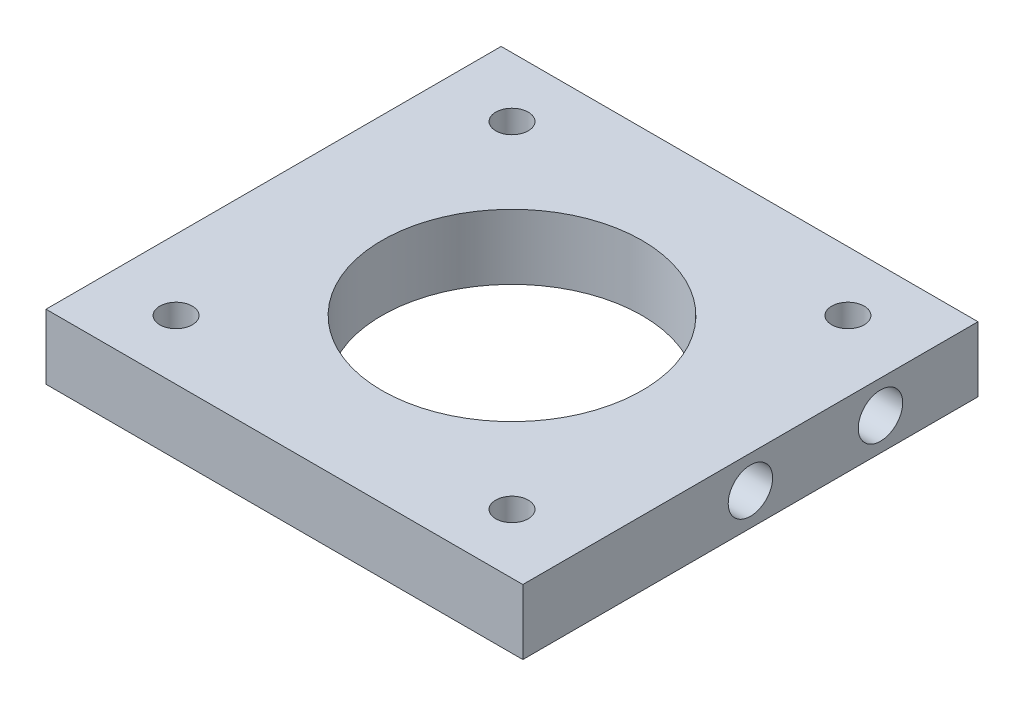
ISO-10303-21;
HEADER;
FILE_DESCRIPTION(('STEP AP214'),'2;1');
FILE_NAME('part.step','',(''),(''),'','','');
FILE_SCHEMA(('AUTOMOTIVE_DESIGN { 1 0 10303 214 1 1 1 1 }'));
ENDSEC;
DATA;
#1=APPLICATION_CONTEXT('core data for automotive mechanical design processes');
#2=APPLICATION_PROTOCOL_DEFINITION('international standard','automotive_design',2000,#1);
#3=PRODUCT_CONTEXT('',#1,'mechanical');
#4=PRODUCT('Part','Part','',(#3));
#5=PRODUCT_RELATED_PRODUCT_CATEGORY('part','',(#4));
#6=PRODUCT_DEFINITION_FORMATION('','',#4);
#7=PRODUCT_DEFINITION_CONTEXT('part definition',#1,'design');
#8=PRODUCT_DEFINITION('design','',#6,#7);
#9=PRODUCT_DEFINITION_SHAPE('','',#8);
#10=(LENGTH_UNIT() NAMED_UNIT(*) SI_UNIT(.MILLI.,.METRE.));
#11=(NAMED_UNIT(*) PLANE_ANGLE_UNIT() SI_UNIT($,.RADIAN.));
#12=(NAMED_UNIT(*) SI_UNIT($,.STERADIAN.) SOLID_ANGLE_UNIT());
#13=UNCERTAINTY_MEASURE_WITH_UNIT(LENGTH_MEASURE(1.E-05),#10,'distance_accuracy_value','');
#14=(GEOMETRIC_REPRESENTATION_CONTEXT(3) GLOBAL_UNCERTAINTY_ASSIGNED_CONTEXT((#13)) GLOBAL_UNIT_ASSIGNED_CONTEXT((#10,
#11,#12)) REPRESENTATION_CONTEXT('',''));
#15=CARTESIAN_POINT('',(0.,0.,0.));
#16=DIRECTION('',(0.,0.,1.));
#17=DIRECTION('',(1.,0.,0.));
#18=AXIS2_PLACEMENT_3D('',#15,#16,#17);
#19=CARTESIAN_POINT('',(-22.,3.,42.));
#20=DIRECTION('',(0.,1.,0.));
#21=DIRECTION('',(0.,0.,1.));
#22=AXIS2_PLACEMENT_3D('',#19,#20,#21);
#23=PLANE('',#22);
#24=CARTESIAN_POINT('',(-15.5,3.,36.5));
#25=DIRECTION('',(0.,1.,0.));
#26=DIRECTION('',(0.,0.,1.));
#27=AXIS2_PLACEMENT_3D('',#24,#25,#26);
#28=CIRCLE('',#27,1.5);
#29=CARTESIAN_POINT('',(-15.5,3.,38.));
#30=VERTEX_POINT('',#29);
#31=EDGE_CURVE('E145',#30,#30,#28,.T.);
#32=ORIENTED_EDGE('',*,*,#31,.F.);
#33=EDGE_LOOP('',(#32));
#34=FACE_BOUND('',#33,.T.);
#35=CARTESIAN_POINT('',(15.5,3.,36.5));
#36=DIRECTION('',(0.,1.,0.));
#37=DIRECTION('',(0.,0.,1.));
#38=AXIS2_PLACEMENT_3D('',#35,#36,#37);
#39=CIRCLE('',#38,1.5);
#40=CARTESIAN_POINT('',(15.5,3.,38.));
#41=VERTEX_POINT('',#40);
#42=EDGE_CURVE('E170',#41,#41,#39,.T.);
#43=ORIENTED_EDGE('',*,*,#42,.F.);
#44=EDGE_LOOP('',(#43));
#45=FACE_BOUND('',#44,.T.);
#46=CARTESIAN_POINT('',(15.5,3.,5.5));
#47=DIRECTION('',(0.,1.,0.));
#48=DIRECTION('',(0.,0.,1.));
#49=AXIS2_PLACEMENT_3D('',#46,#47,#48);
#50=CIRCLE('',#49,1.5);
#51=CARTESIAN_POINT('',(15.5,3.,7.));
#52=VERTEX_POINT('',#51);
#53=EDGE_CURVE('E164',#52,#52,#50,.T.);
#54=ORIENTED_EDGE('',*,*,#53,.F.);
#55=EDGE_LOOP('',(#54));
#56=FACE_BOUND('',#55,.T.);
#57=CARTESIAN_POINT('',(-15.5,3.,5.5));
#58=DIRECTION('',(0.,1.,0.));
#59=DIRECTION('',(0.,0.,1.));
#60=AXIS2_PLACEMENT_3D('',#57,#58,#59);
#61=CIRCLE('',#60,1.5);
#62=CARTESIAN_POINT('',(-15.5,3.,7.));
#63=VERTEX_POINT('',#62);
#64=EDGE_CURVE('E156',#63,#63,#61,.T.);
#65=ORIENTED_EDGE('',*,*,#64,.F.);
#66=EDGE_LOOP('',(#65));
#67=FACE_BOUND('',#66,.T.);
#68=CARTESIAN_POINT('',(0.,3.,21.));
#69=DIRECTION('',(0.,1.,0.));
#70=DIRECTION('',(0.,0.,1.));
#71=AXIS2_PLACEMENT_3D('',#68,#69,#70);
#72=CIRCLE('',#71,12.);
#73=CARTESIAN_POINT('',(0.,3.,33.));
#74=VERTEX_POINT('',#73);
#75=EDGE_CURVE('E163',#74,#74,#72,.T.);
#76=ORIENTED_EDGE('',*,*,#75,.F.);
#77=EDGE_LOOP('',(#76));
#78=FACE_BOUND('',#77,.T.);
#79=DIRECTION('',(1.,0.,0.));
#80=VECTOR('',#79,1.);
#81=CARTESIAN_POINT('',(-22.,3.,0.));
#82=LINE('',#81,#80);
#83=CARTESIAN_POINT('',(-22.,3.,0.));
#84=VERTEX_POINT('',#83);
#85=CARTESIAN_POINT('',(22.,3.,0.));
#86=VERTEX_POINT('',#85);
#87=EDGE_CURVE('E97',#84,#86,#82,.T.);
#88=ORIENTED_EDGE('',*,*,#87,.F.);
#89=DIRECTION('',(0.,0.,-1.));
#90=VECTOR('',#89,1.);
#91=CARTESIAN_POINT('',(-22.,3.,42.));
#92=LINE('',#91,#90);
#93=CARTESIAN_POINT('',(-22.,3.,42.));
#94=VERTEX_POINT('',#93);
#95=EDGE_CURVE('E11',#94,#84,#92,.T.);
#96=ORIENTED_EDGE('',*,*,#95,.F.);
#97=DIRECTION('',(1.,0.,0.));
#98=VECTOR('',#97,1.);
#99=CARTESIAN_POINT('',(-22.,3.,42.));
#100=LINE('',#99,#98);
#101=CARTESIAN_POINT('',(22.,3.,42.));
#102=VERTEX_POINT('',#101);
#103=EDGE_CURVE('E90',#94,#102,#100,.T.);
#104=ORIENTED_EDGE('',*,*,#103,.T.);
#105=DIRECTION('',(0.,0.,-1.));
#106=VECTOR('',#105,1.);
#107=CARTESIAN_POINT('',(22.,3.,42.));
#108=LINE('',#107,#106);
#109=EDGE_CURVE('E35',#102,#86,#108,.T.);
#110=ORIENTED_EDGE('',*,*,#109,.T.);
#111=EDGE_LOOP('',(#88,#96,#104,#110));
#112=FACE_BOUND('',#111,.T.);
#113=ADVANCED_FACE('F32',(#34,#45,#56,#67,#78,#112),#23,.T.);
#114=CARTESIAN_POINT('',(-22.,-3.,42.));
#115=DIRECTION('',(-1.,0.,0.));
#116=DIRECTION('',(0.,-1.,0.));
#117=AXIS2_PLACEMENT_3D('',#114,#115,#116);
#118=PLANE('',#117);
#119=CARTESIAN_POINT('',(-22.,0.,9.));
#120=DIRECTION('',(-1.,0.,0.));
#121=DIRECTION('',(0.,-1.,0.));
#122=AXIS2_PLACEMENT_3D('',#119,#120,#121);
#123=CIRCLE('',#122,2.05);
#124=CARTESIAN_POINT('',(-22.,-2.04999999999999,9.));
#125=VERTEX_POINT('',#124);
#126=EDGE_CURVE('E146',#125,#125,#123,.T.);
#127=ORIENTED_EDGE('',*,*,#126,.F.);
#128=EDGE_LOOP('',(#127));
#129=FACE_BOUND('',#128,.T.);
#130=CARTESIAN_POINT('',(-22.,0.,21.));
#131=DIRECTION('',(-1.,0.,0.));
#132=DIRECTION('',(0.,-1.,0.));
#133=AXIS2_PLACEMENT_3D('',#130,#131,#132);
#134=CIRCLE('',#133,2.05);
#135=CARTESIAN_POINT('',(-22.,-2.04999999999999,21.));
#136=VERTEX_POINT('',#135);
#137=EDGE_CURVE('E152',#136,#136,#134,.T.);
#138=ORIENTED_EDGE('',*,*,#137,.F.);
#139=EDGE_LOOP('',(#138));
#140=FACE_BOUND('',#139,.T.);
#141=DIRECTION('',(0.,1.,0.));
#142=VECTOR('',#141,1.);
#143=CARTESIAN_POINT('',(-22.,-3.,0.));
#144=LINE('',#143,#142);
#145=CARTESIAN_POINT('',(-22.,-3.,0.));
#146=VERTEX_POINT('',#145);
#147=EDGE_CURVE('E92',#146,#84,#144,.T.);
#148=ORIENTED_EDGE('',*,*,#147,.F.);
#149=DIRECTION('',(0.,0.,-1.));
#150=VECTOR('',#149,1.);
#151=CARTESIAN_POINT('',(-22.,-3.,42.));
#152=LINE('',#151,#150);
#153=CARTESIAN_POINT('',(-22.,-3.,42.));
#154=VERTEX_POINT('',#153);
#155=EDGE_CURVE('E41',#154,#146,#152,.T.);
#156=ORIENTED_EDGE('',*,*,#155,.F.);
#157=DIRECTION('',(0.,1.,0.));
#158=VECTOR('',#157,1.);
#159=CARTESIAN_POINT('',(-22.,-3.,42.));
#160=LINE('',#159,#158);
#161=EDGE_CURVE('E80',#154,#94,#160,.T.);
#162=ORIENTED_EDGE('',*,*,#161,.T.);
#163=ORIENTED_EDGE('',*,*,#95,.T.);
#164=EDGE_LOOP('',(#148,#156,#162,#163));
#165=FACE_BOUND('',#164,.T.);
#166=ADVANCED_FACE('F108',(#129,#140,#165),#118,.T.);
#167=CARTESIAN_POINT('',(-22.,-3.,42.));
#168=DIRECTION('',(0.,1.,0.));
#169=DIRECTION('',(0.,0.,1.));
#170=AXIS2_PLACEMENT_3D('',#167,#168,#169);
#171=PLANE('',#170);
#172=CARTESIAN_POINT('',(-15.5,-3.,36.5));
#173=DIRECTION('',(0.,1.,0.));
#174=DIRECTION('',(0.,0.,1.));
#175=AXIS2_PLACEMENT_3D('',#172,#173,#174);
#176=CIRCLE('',#175,1.5);
#177=CARTESIAN_POINT('',(-15.5,-3.,38.));
#178=VERTEX_POINT('',#177);
#179=EDGE_CURVE('E173',#178,#178,#176,.F.);
#180=ORIENTED_EDGE('',*,*,#179,.F.);
#181=EDGE_LOOP('',(#180));
#182=FACE_BOUND('',#181,.T.);
#183=CARTESIAN_POINT('',(15.5,-3.,36.5));
#184=DIRECTION('',(0.,1.,0.));
#185=DIRECTION('',(0.,0.,1.));
#186=AXIS2_PLACEMENT_3D('',#183,#184,#185);
#187=CIRCLE('',#186,1.5);
#188=CARTESIAN_POINT('',(15.5,-3.,38.));
#189=VERTEX_POINT('',#188);
#190=EDGE_CURVE('E167',#189,#189,#187,.F.);
#191=ORIENTED_EDGE('',*,*,#190,.F.);
#192=EDGE_LOOP('',(#191));
#193=FACE_BOUND('',#192,.T.);
#194=CARTESIAN_POINT('',(15.5,-3.,5.5));
#195=DIRECTION('',(0.,1.,0.));
#196=DIRECTION('',(0.,0.,1.));
#197=AXIS2_PLACEMENT_3D('',#194,#195,#196);
#198=CIRCLE('',#197,1.5);
#199=CARTESIAN_POINT('',(15.5,-3.,7.));
#200=VERTEX_POINT('',#199);
#201=EDGE_CURVE('E160',#200,#200,#198,.F.);
#202=ORIENTED_EDGE('',*,*,#201,.F.);
#203=EDGE_LOOP('',(#202));
#204=FACE_BOUND('',#203,.T.);
#205=CARTESIAN_POINT('',(-15.5,-3.,5.5));
#206=DIRECTION('',(0.,1.,0.));
#207=DIRECTION('',(0.,0.,1.));
#208=AXIS2_PLACEMENT_3D('',#205,#206,#207);
#209=CIRCLE('',#208,1.5);
#210=CARTESIAN_POINT('',(-15.5,-3.,7.));
#211=VERTEX_POINT('',#210);
#212=EDGE_CURVE('E159',#211,#211,#209,.F.);
#213=ORIENTED_EDGE('',*,*,#212,.F.);
#214=EDGE_LOOP('',(#213));
#215=FACE_BOUND('',#214,.T.);
#216=CARTESIAN_POINT('',(0.,-3.,21.));
#217=DIRECTION('',(0.,1.,0.));
#218=DIRECTION('',(0.,0.,1.));
#219=AXIS2_PLACEMENT_3D('',#216,#217,#218);
#220=CIRCLE('',#219,12.);
#221=CARTESIAN_POINT('',(0.,-3.,33.));
#222=VERTEX_POINT('',#221);
#223=EDGE_CURVE('E101',#222,#222,#220,.F.);
#224=ORIENTED_EDGE('',*,*,#223,.F.);
#225=EDGE_LOOP('',(#224));
#226=FACE_BOUND('',#225,.T.);
#227=DIRECTION('',(1.,0.,0.));
#228=VECTOR('',#227,1.);
#229=CARTESIAN_POINT('',(-22.,-3.,0.));
#230=LINE('',#229,#228);
#231=CARTESIAN_POINT('',(22.,-3.,0.));
#232=VERTEX_POINT('',#231);
#233=EDGE_CURVE('E85',#146,#232,#230,.T.);
#234=ORIENTED_EDGE('',*,*,#233,.T.);
#235=DIRECTION('',(0.,0.,-1.));
#236=VECTOR('',#235,1.);
#237=CARTESIAN_POINT('',(22.,-3.,42.));
#238=LINE('',#237,#236);
#239=CARTESIAN_POINT('',(22.,-3.,42.));
#240=VERTEX_POINT('',#239);
#241=EDGE_CURVE('E83',#240,#232,#238,.T.);
#242=ORIENTED_EDGE('',*,*,#241,.F.);
#243=DIRECTION('',(1.,0.,0.));
#244=VECTOR('',#243,1.);
#245=CARTESIAN_POINT('',(-22.,-3.,42.));
#246=LINE('',#245,#244);
#247=EDGE_CURVE('E77',#154,#240,#246,.T.);
#248=ORIENTED_EDGE('',*,*,#247,.F.);
#249=ORIENTED_EDGE('',*,*,#155,.T.);
#250=EDGE_LOOP('',(#234,#242,#248,#249));
#251=FACE_BOUND('',#250,.T.);
#252=ADVANCED_FACE('F84',(#182,#193,#204,#215,#226,#251),#171,.F.);
#253=CARTESIAN_POINT('',(22.,-3.,42.));
#254=DIRECTION('',(-1.,0.,0.));
#255=DIRECTION('',(0.,-1.,0.));
#256=AXIS2_PLACEMENT_3D('',#253,#254,#255);
#257=PLANE('',#256);
#258=CARTESIAN_POINT('',(22.,0.,9.));
#259=DIRECTION('',(1.,0.,0.));
#260=DIRECTION('',(0.,1.,0.));
#261=AXIS2_PLACEMENT_3D('',#258,#259,#260);
#262=CIRCLE('',#261,2.05);
#263=CARTESIAN_POINT('',(22.,2.04999999999999,9.));
#264=VERTEX_POINT('',#263);
#265=EDGE_CURVE('E131',#264,#264,#262,.T.);
#266=ORIENTED_EDGE('',*,*,#265,.F.);
#267=EDGE_LOOP('',(#266));
#268=FACE_BOUND('',#267,.T.);
#269=CARTESIAN_POINT('',(22.,0.,21.));
#270=DIRECTION('',(1.,0.,0.));
#271=DIRECTION('',(0.,1.,0.));
#272=AXIS2_PLACEMENT_3D('',#269,#270,#271);
#273=CIRCLE('',#272,2.05);
#274=CARTESIAN_POINT('',(22.,2.04999999999999,21.));
#275=VERTEX_POINT('',#274);
#276=EDGE_CURVE('E134',#275,#275,#273,.T.);
#277=ORIENTED_EDGE('',*,*,#276,.F.);
#278=EDGE_LOOP('',(#277));
#279=FACE_BOUND('',#278,.T.);
#280=DIRECTION('',(0.,1.,0.));
#281=VECTOR('',#280,1.);
#282=CARTESIAN_POINT('',(22.,-3.,0.));
#283=LINE('',#282,#281);
#284=EDGE_CURVE('E100',#232,#86,#283,.T.);
#285=ORIENTED_EDGE('',*,*,#284,.T.);
#286=ORIENTED_EDGE('',*,*,#109,.F.);
#287=DIRECTION('',(0.,1.,0.));
#288=VECTOR('',#287,1.);
#289=CARTESIAN_POINT('',(22.,-3.,42.));
#290=LINE('',#289,#288);
#291=EDGE_CURVE('E74',#240,#102,#290,.T.);
#292=ORIENTED_EDGE('',*,*,#291,.F.);
#293=ORIENTED_EDGE('',*,*,#241,.T.);
#294=EDGE_LOOP('',(#285,#286,#292,#293));
#295=FACE_BOUND('',#294,.T.);
#296=ADVANCED_FACE('F89',(#268,#279,#295),#257,.F.);
#297=CARTESIAN_POINT('',(0.,0.,42.));
#298=DIRECTION('',(0.,0.,1.));
#299=DIRECTION('',(1.,0.,0.));
#300=AXIS2_PLACEMENT_3D('',#297,#298,#299);
#301=PLANE('',#300);
#302=ORIENTED_EDGE('',*,*,#103,.F.);
#303=ORIENTED_EDGE('',*,*,#161,.F.);
#304=ORIENTED_EDGE('',*,*,#247,.T.);
#305=ORIENTED_EDGE('',*,*,#291,.T.);
#306=EDGE_LOOP('',(#302,#303,#304,#305));
#307=FACE_BOUND('',#306,.T.);
#308=ADVANCED_FACE('F79',(#307),#301,.T.);
#309=CARTESIAN_POINT('',(0.,0.,0.));
#310=DIRECTION('',(0.,0.,1.));
#311=DIRECTION('',(1.,0.,0.));
#312=AXIS2_PLACEMENT_3D('',#309,#310,#311);
#313=PLANE('',#312);
#314=ORIENTED_EDGE('',*,*,#87,.T.);
#315=ORIENTED_EDGE('',*,*,#284,.F.);
#316=ORIENTED_EDGE('',*,*,#233,.F.);
#317=ORIENTED_EDGE('',*,*,#147,.T.);
#318=EDGE_LOOP('',(#314,#315,#316,#317));
#319=FACE_BOUND('',#318,.T.);
#320=ADVANCED_FACE('F107',(#319),#313,.F.);
#321=CARTESIAN_POINT('',(0.,-3.001,21.));
#322=DIRECTION('',(0.,1.,0.));
#323=DIRECTION('',(0.,0.,1.));
#324=AXIS2_PLACEMENT_3D('',#321,#322,#323);
#325=CYLINDRICAL_SURFACE('',#324,12.);
#326=ORIENTED_EDGE('',*,*,#75,.T.);
#327=EDGE_LOOP('',(#326));
#328=FACE_BOUND('',#327,.T.);
#329=ORIENTED_EDGE('',*,*,#223,.T.);
#330=EDGE_LOOP('',(#329));
#331=FACE_BOUND('',#330,.T.);
#332=ADVANCED_FACE('F184',(#328,#331),#325,.F.);
#333=CARTESIAN_POINT('',(-15.5,-3.001,5.5));
#334=DIRECTION('',(0.,1.,0.));
#335=DIRECTION('',(0.,0.,1.));
#336=AXIS2_PLACEMENT_3D('',#333,#334,#335);
#337=CYLINDRICAL_SURFACE('',#336,1.5);
#338=ORIENTED_EDGE('',*,*,#64,.T.);
#339=EDGE_LOOP('',(#338));
#340=FACE_BOUND('',#339,.T.);
#341=ORIENTED_EDGE('',*,*,#212,.T.);
#342=EDGE_LOOP('',(#341));
#343=FACE_BOUND('',#342,.T.);
#344=ADVANCED_FACE('F187',(#340,#343),#337,.F.);
#345=CARTESIAN_POINT('',(15.5,-3.001,5.5));
#346=DIRECTION('',(0.,1.,0.));
#347=DIRECTION('',(0.,0.,1.));
#348=AXIS2_PLACEMENT_3D('',#345,#346,#347);
#349=CYLINDRICAL_SURFACE('',#348,1.5);
#350=ORIENTED_EDGE('',*,*,#53,.T.);
#351=EDGE_LOOP('',(#350));
#352=FACE_BOUND('',#351,.T.);
#353=ORIENTED_EDGE('',*,*,#201,.T.);
#354=EDGE_LOOP('',(#353));
#355=FACE_BOUND('',#354,.T.);
#356=ADVANCED_FACE('F194',(#352,#355),#349,.F.);
#357=CARTESIAN_POINT('',(15.5,-3.001,36.5));
#358=DIRECTION('',(0.,1.,0.));
#359=DIRECTION('',(0.,0.,1.));
#360=AXIS2_PLACEMENT_3D('',#357,#358,#359);
#361=CYLINDRICAL_SURFACE('',#360,1.5);
#362=ORIENTED_EDGE('',*,*,#42,.T.);
#363=EDGE_LOOP('',(#362));
#364=FACE_BOUND('',#363,.T.);
#365=ORIENTED_EDGE('',*,*,#190,.T.);
#366=EDGE_LOOP('',(#365));
#367=FACE_BOUND('',#366,.T.);
#368=ADVANCED_FACE('F202',(#364,#367),#361,.F.);
#369=CARTESIAN_POINT('',(-15.5,-3.001,36.5));
#370=DIRECTION('',(0.,1.,0.));
#371=DIRECTION('',(0.,0.,1.));
#372=AXIS2_PLACEMENT_3D('',#369,#370,#371);
#373=CYLINDRICAL_SURFACE('',#372,1.5);
#374=ORIENTED_EDGE('',*,*,#31,.T.);
#375=EDGE_LOOP('',(#374));
#376=FACE_BOUND('',#375,.T.);
#377=ORIENTED_EDGE('',*,*,#179,.T.);
#378=EDGE_LOOP('',(#377));
#379=FACE_BOUND('',#378,.T.);
#380=ADVANCED_FACE('F198',(#376,#379),#373,.F.);
#381=CARTESIAN_POINT('',(-16.,0.,21.));
#382=DIRECTION('',(-1.,0.,0.));
#383=DIRECTION('',(0.,-1.,0.));
#384=AXIS2_PLACEMENT_3D('',#381,#382,#383);
#385=CYLINDRICAL_SURFACE('',#384,2.05);
#386=CARTESIAN_POINT('',(-16.,0.,21.));
#387=DIRECTION('',(-1.,0.,0.));
#388=DIRECTION('',(0.,-1.,0.));
#389=AXIS2_PLACEMENT_3D('',#386,#387,#388);
#390=CIRCLE('',#389,2.05);
#391=CARTESIAN_POINT('',(-16.,-2.04999999999998,21.));
#392=VERTEX_POINT('',#391);
#393=EDGE_CURVE('E149',#392,#392,#390,.T.);
#394=ORIENTED_EDGE('',*,*,#393,.F.);
#395=EDGE_LOOP('',(#394));
#396=FACE_BOUND('',#395,.T.);
#397=ORIENTED_EDGE('',*,*,#137,.T.);
#398=EDGE_LOOP('',(#397));
#399=FACE_BOUND('',#398,.T.);
#400=ADVANCED_FACE('F201',(#396,#399),#385,.F.);
#401=CARTESIAN_POINT('',(-16.,0.,21.));
#402=DIRECTION('',(-1.,0.,0.));
#403=DIRECTION('',(0.,-1.,0.));
#404=AXIS2_PLACEMENT_3D('',#401,#402,#403);
#405=PLANE('',#404);
#406=ORIENTED_EDGE('',*,*,#393,.T.);
#407=EDGE_LOOP('',(#406));
#408=FACE_BOUND('',#407,.T.);
#409=ADVANCED_FACE('F212',(#408),#405,.T.);
#410=CARTESIAN_POINT('',(-16.,0.,9.));
#411=DIRECTION('',(-1.,0.,0.));
#412=DIRECTION('',(0.,-1.,0.));
#413=AXIS2_PLACEMENT_3D('',#410,#411,#412);
#414=CYLINDRICAL_SURFACE('',#413,2.05);
#415=CARTESIAN_POINT('',(-16.,0.,9.));
#416=DIRECTION('',(-1.,0.,0.));
#417=DIRECTION('',(0.,-1.,0.));
#418=AXIS2_PLACEMENT_3D('',#415,#416,#417);
#419=CIRCLE('',#418,2.05);
#420=CARTESIAN_POINT('',(-16.,-2.04999999999998,9.));
#421=VERTEX_POINT('',#420);
#422=EDGE_CURVE('E142',#421,#421,#419,.T.);
#423=ORIENTED_EDGE('',*,*,#422,.F.);
#424=EDGE_LOOP('',(#423));
#425=FACE_BOUND('',#424,.T.);
#426=ORIENTED_EDGE('',*,*,#126,.T.);
#427=EDGE_LOOP('',(#426));
#428=FACE_BOUND('',#427,.T.);
#429=ADVANCED_FACE('F216',(#425,#428),#414,.F.);
#430=CARTESIAN_POINT('',(-16.,0.,9.));
#431=DIRECTION('',(-1.,0.,0.));
#432=DIRECTION('',(0.,-1.,0.));
#433=AXIS2_PLACEMENT_3D('',#430,#431,#432);
#434=PLANE('',#433);
#435=ORIENTED_EDGE('',*,*,#422,.T.);
#436=EDGE_LOOP('',(#435));
#437=FACE_BOUND('',#436,.T.);
#438=ADVANCED_FACE('F220',(#437),#434,.T.);
#439=CARTESIAN_POINT('',(16.,0.,21.));
#440=DIRECTION('',(1.,0.,0.));
#441=DIRECTION('',(0.,1.,0.));
#442=AXIS2_PLACEMENT_3D('',#439,#440,#441);
#443=CYLINDRICAL_SURFACE('',#442,2.05);
#444=CARTESIAN_POINT('',(16.,0.,21.));
#445=DIRECTION('',(1.,0.,0.));
#446=DIRECTION('',(0.,1.,0.));
#447=AXIS2_PLACEMENT_3D('',#444,#445,#446);
#448=CIRCLE('',#447,2.05);
#449=CARTESIAN_POINT('',(16.,2.04999999999999,21.));
#450=VERTEX_POINT('',#449);
#451=EDGE_CURVE('E136',#450,#450,#448,.T.);
#452=ORIENTED_EDGE('',*,*,#451,.F.);
#453=EDGE_LOOP('',(#452));
#454=FACE_BOUND('',#453,.T.);
#455=ORIENTED_EDGE('',*,*,#276,.T.);
#456=EDGE_LOOP('',(#455));
#457=FACE_BOUND('',#456,.T.);
#458=ADVANCED_FACE('F224',(#454,#457),#443,.F.);
#459=CARTESIAN_POINT('',(16.,0.,21.));
#460=DIRECTION('',(1.,0.,0.));
#461=DIRECTION('',(0.,1.,0.));
#462=AXIS2_PLACEMENT_3D('',#459,#460,#461);
#463=PLANE('',#462);
#464=ORIENTED_EDGE('',*,*,#451,.T.);
#465=EDGE_LOOP('',(#464));
#466=FACE_BOUND('',#465,.T.);
#467=ADVANCED_FACE('F228',(#466),#463,.T.);
#468=CARTESIAN_POINT('',(16.,0.,9.));
#469=DIRECTION('',(1.,0.,0.));
#470=DIRECTION('',(0.,1.,0.));
#471=AXIS2_PLACEMENT_3D('',#468,#469,#470);
#472=CYLINDRICAL_SURFACE('',#471,2.05);
#473=CARTESIAN_POINT('',(16.,0.,9.));
#474=DIRECTION('',(1.,0.,0.));
#475=DIRECTION('',(0.,1.,0.));
#476=AXIS2_PLACEMENT_3D('',#473,#474,#475);
#477=CIRCLE('',#476,2.05);
#478=CARTESIAN_POINT('',(16.,2.04999999999999,9.));
#479=VERTEX_POINT('',#478);
#480=EDGE_CURVE('E155',#479,#479,#477,.T.);
#481=ORIENTED_EDGE('',*,*,#480,.F.);
#482=EDGE_LOOP('',(#481));
#483=FACE_BOUND('',#482,.T.);
#484=ORIENTED_EDGE('',*,*,#265,.T.);
#485=EDGE_LOOP('',(#484));
#486=FACE_BOUND('',#485,.T.);
#487=ADVANCED_FACE('F232',(#483,#486),#472,.F.);
#488=CARTESIAN_POINT('',(16.,0.,9.));
#489=DIRECTION('',(1.,0.,0.));
#490=DIRECTION('',(0.,1.,0.));
#491=AXIS2_PLACEMENT_3D('',#488,#489,#490);
#492=PLANE('',#491);
#493=ORIENTED_EDGE('',*,*,#480,.T.);
#494=EDGE_LOOP('',(#493));
#495=FACE_BOUND('',#494,.T.);
#496=ADVANCED_FACE('F236',(#495),#492,.T.);
#497=CLOSED_SHELL('',(#113,#166,#252,#296,#308,#320,#332,#344,#356,#368,#380,#400,#409,#429,
#438,#458,#467,#487,#496));
#498=MANIFOLD_SOLID_BREP('B2',#497);
#499=ADVANCED_BREP_SHAPE_REPRESENTATION('',(#18,#498),#14);
#500=SHAPE_DEFINITION_REPRESENTATION(#9,#499);
ENDSEC;
END-ISO-10303-21;
